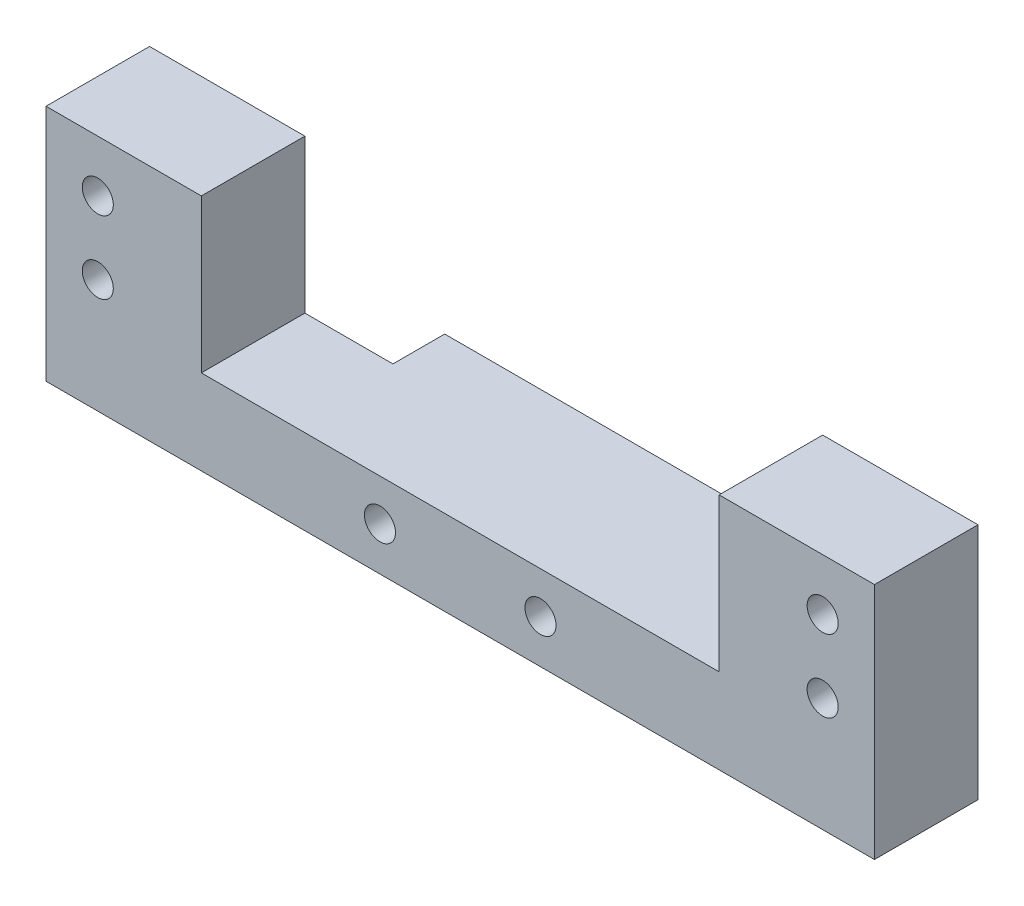
ISO-10303-21;
HEADER;
FILE_DESCRIPTION(('STEP AP214'),'2;1');
FILE_NAME('part.step','',(''),(''),'','','');
FILE_SCHEMA(('AUTOMOTIVE_DESIGN { 1 0 10303 214 1 1 1 1 }'));
ENDSEC;
DATA;
#1=APPLICATION_CONTEXT('core data for automotive mechanical design processes');
#2=APPLICATION_PROTOCOL_DEFINITION('international standard','automotive_design',2000,#1);
#3=PRODUCT_CONTEXT('',#1,'mechanical');
#4=PRODUCT('Part','Part','',(#3));
#5=PRODUCT_RELATED_PRODUCT_CATEGORY('part','',(#4));
#6=PRODUCT_DEFINITION_FORMATION('','',#4);
#7=PRODUCT_DEFINITION_CONTEXT('part definition',#1,'design');
#8=PRODUCT_DEFINITION('design','',#6,#7);
#9=PRODUCT_DEFINITION_SHAPE('','',#8);
#10=(LENGTH_UNIT() NAMED_UNIT(*) SI_UNIT(.MILLI.,.METRE.));
#11=(NAMED_UNIT(*) PLANE_ANGLE_UNIT() SI_UNIT($,.RADIAN.));
#12=(NAMED_UNIT(*) SI_UNIT($,.STERADIAN.) SOLID_ANGLE_UNIT());
#13=UNCERTAINTY_MEASURE_WITH_UNIT(LENGTH_MEASURE(1.E-05),#10,'distance_accuracy_value','');
#14=(GEOMETRIC_REPRESENTATION_CONTEXT(3) GLOBAL_UNCERTAINTY_ASSIGNED_CONTEXT((#13)) GLOBAL_UNIT_ASSIGNED_CONTEXT((#10,
#11,#12)) REPRESENTATION_CONTEXT('',''));
#15=CARTESIAN_POINT('',(0.,0.,0.));
#16=DIRECTION('',(0.,0.,1.));
#17=DIRECTION('',(1.,0.,0.));
#18=AXIS2_PLACEMENT_3D('',#15,#16,#17);
#19=CARTESIAN_POINT('',(0.,0.,0.));
#20=DIRECTION('',(0.,0.,-1.));
#21=DIRECTION('',(-1.,0.,0.));
#22=AXIS2_PLACEMENT_3D('',#19,#20,#21);
#23=PLANE('',#22);
#24=DIRECTION('',(0.,-1.,0.));
#25=VECTOR('',#24,1.);
#26=CARTESIAN_POINT('',(56.5,8.2,0.));
#27=LINE('',#26,#25);
#28=CARTESIAN_POINT('',(56.5,8.2,0.));
#29=VERTEX_POINT('',#28);
#30=CARTESIAN_POINT('',(56.5,0.,0.));
#31=VERTEX_POINT('',#30);
#32=EDGE_CURVE('E149',#29,#31,#27,.T.);
#33=ORIENTED_EDGE('',*,*,#32,.F.);
#34=DIRECTION('',(1.,0.,0.));
#35=VECTOR('',#34,1.);
#36=CARTESIAN_POINT('',(15.,8.2,0.));
#37=LINE('',#36,#35);
#38=CARTESIAN_POINT('',(65.,8.2,0.));
#39=VERTEX_POINT('',#38);
#40=EDGE_CURVE('E183',#29,#39,#37,.T.);
#41=ORIENTED_EDGE('',*,*,#40,.T.);
#42=DIRECTION('',(0.,1.,0.));
#43=VECTOR('',#42,1.);
#44=CARTESIAN_POINT('',(65.,23.,0.));
#45=LINE('',#44,#43);
#46=CARTESIAN_POINT('',(65.,23.,0.));
#47=VERTEX_POINT('',#46);
#48=EDGE_CURVE('E187',#39,#47,#45,.T.);
#49=ORIENTED_EDGE('',*,*,#48,.T.);
#50=DIRECTION('',(-1.,0.,0.));
#51=VECTOR('',#50,1.);
#52=CARTESIAN_POINT('',(0.,23.,0.));
#53=LINE('',#52,#51);
#54=CARTESIAN_POINT('',(80.,23.,0.));
#55=VERTEX_POINT('',#54);
#56=EDGE_CURVE('E210',#55,#47,#53,.T.);
#57=ORIENTED_EDGE('',*,*,#56,.F.);
#58=DIRECTION('',(0.,1.,0.));
#59=VECTOR('',#58,1.);
#60=CARTESIAN_POINT('',(80.,0.,0.));
#61=LINE('',#60,#59);
#62=CARTESIAN_POINT('',(80.,0.,0.));
#63=VERTEX_POINT('',#62);
#64=EDGE_CURVE('E223',#63,#55,#61,.T.);
#65=ORIENTED_EDGE('',*,*,#64,.F.);
#66=DIRECTION('',(1.,0.,0.));
#67=VECTOR('',#66,1.);
#68=CARTESIAN_POINT('',(0.,0.,0.));
#69=LINE('',#68,#67);
#70=EDGE_CURVE('E54',#31,#63,#69,.T.);
#71=ORIENTED_EDGE('',*,*,#70,.F.);
#72=EDGE_LOOP('',(#33,#41,#49,#57,#65,#71));
#73=FACE_BOUND('',#72,.T.);
#74=CARTESIAN_POINT('',(75.,11.,0.));
#75=DIRECTION('',(0.,0.,1.));
#76=DIRECTION('',(-1.,0.,0.));
#77=AXIS2_PLACEMENT_3D('',#74,#75,#76);
#78=CIRCLE('',#77,1.5);
#79=CARTESIAN_POINT('',(73.5,11.,0.));
#80=VERTEX_POINT('',#79);
#81=EDGE_CURVE('E166',#80,#80,#78,.T.);
#82=ORIENTED_EDGE('',*,*,#81,.T.);
#83=EDGE_LOOP('',(#82));
#84=FACE_BOUND('',#83,.T.);
#85=CARTESIAN_POINT('',(75.,18.,0.));
#86=DIRECTION('',(0.,0.,1.));
#87=DIRECTION('',(-1.,0.,0.));
#88=AXIS2_PLACEMENT_3D('',#85,#86,#87);
#89=CIRCLE('',#88,1.50000000000001);
#90=CARTESIAN_POINT('',(73.5,18.,0.));
#91=VERTEX_POINT('',#90);
#92=EDGE_CURVE('E153',#91,#91,#89,.T.);
#93=ORIENTED_EDGE('',*,*,#92,.T.);
#94=EDGE_LOOP('',(#93));
#95=FACE_BOUND('',#94,.T.);
#96=ADVANCED_FACE('F37',(#73,#84,#95),#23,.T.);
#97=CARTESIAN_POINT('',(0.,23.,10.));
#98=DIRECTION('',(0.,-1.,0.));
#99=DIRECTION('',(0.,0.,-1.));
#100=AXIS2_PLACEMENT_3D('',#97,#98,#99);
#101=PLANE('',#100);
#102=DIRECTION('',(-1.,0.,0.));
#103=VECTOR('',#102,1.);
#104=CARTESIAN_POINT('',(0.,23.,10.));
#105=LINE('',#104,#103);
#106=CARTESIAN_POINT('',(15.,23.,10.));
#107=VERTEX_POINT('',#106);
#108=CARTESIAN_POINT('',(0.,23.,10.));
#109=VERTEX_POINT('',#108);
#110=EDGE_CURVE('E214',#107,#109,#105,.T.);
#111=ORIENTED_EDGE('',*,*,#110,.F.);
#112=DIRECTION('',(0.,0.,1.));
#113=VECTOR('',#112,1.);
#114=CARTESIAN_POINT('',(15.,23.,0.));
#115=LINE('',#114,#113);
#116=CARTESIAN_POINT('',(15.,23.,0.));
#117=VERTEX_POINT('',#116);
#118=EDGE_CURVE('E197',#117,#107,#115,.T.);
#119=ORIENTED_EDGE('',*,*,#118,.F.);
#120=CARTESIAN_POINT('',(0.,23.,0.));
#121=VERTEX_POINT('',#120);
#122=EDGE_CURVE('E225',#117,#121,#53,.T.);
#123=ORIENTED_EDGE('',*,*,#122,.T.);
#124=DIRECTION('',(0.,0.,-1.));
#125=VECTOR('',#124,1.);
#126=CARTESIAN_POINT('',(0.,23.,10.));
#127=LINE('',#126,#125);
#128=EDGE_CURVE('E218',#109,#121,#127,.T.);
#129=ORIENTED_EDGE('',*,*,#128,.F.);
#130=EDGE_LOOP('',(#111,#119,#123,#129));
#131=FACE_BOUND('',#130,.T.);
#132=ADVANCED_FACE('F272',(#131),#101,.F.);
#133=CARTESIAN_POINT('',(0.,0.,10.));
#134=DIRECTION('',(1.,0.,0.));
#135=DIRECTION('',(0.,0.,-1.));
#136=AXIS2_PLACEMENT_3D('',#133,#134,#135);
#137=PLANE('',#136);
#138=DIRECTION('',(0.,-1.,0.));
#139=VECTOR('',#138,1.);
#140=CARTESIAN_POINT('',(0.,0.,0.));
#141=LINE('',#140,#139);
#142=CARTESIAN_POINT('',(0.,0.,0.));
#143=VERTEX_POINT('',#142);
#144=EDGE_CURVE('E199',#121,#143,#141,.T.);
#145=ORIENTED_EDGE('',*,*,#144,.T.);
#146=DIRECTION('',(0.,0.,-1.));
#147=VECTOR('',#146,1.);
#148=CARTESIAN_POINT('',(0.,0.,10.));
#149=LINE('',#148,#147);
#150=CARTESIAN_POINT('',(0.,0.,10.));
#151=VERTEX_POINT('',#150);
#152=EDGE_CURVE('E11',#151,#143,#149,.T.);
#153=ORIENTED_EDGE('',*,*,#152,.F.);
#154=DIRECTION('',(0.,-1.,0.));
#155=VECTOR('',#154,1.);
#156=CARTESIAN_POINT('',(0.,0.,10.));
#157=LINE('',#156,#155);
#158=EDGE_CURVE('E206',#109,#151,#157,.T.);
#159=ORIENTED_EDGE('',*,*,#158,.F.);
#160=ORIENTED_EDGE('',*,*,#128,.T.);
#161=EDGE_LOOP('',(#145,#153,#159,#160));
#162=FACE_BOUND('',#161,.T.);
#163=ADVANCED_FACE('F39',(#162),#137,.F.);
#164=CARTESIAN_POINT('',(0.,0.,10.));
#165=DIRECTION('',(0.,1.,0.));
#166=DIRECTION('',(0.,0.,1.));
#167=AXIS2_PLACEMENT_3D('',#164,#165,#166);
#168=PLANE('',#167);
#169=CARTESIAN_POINT('',(23.5,0.,0.));
#170=VERTEX_POINT('',#169);
#171=EDGE_CURVE('E221',#143,#170,#69,.T.);
#172=ORIENTED_EDGE('',*,*,#171,.T.);
#173=DIRECTION('',(0.,0.,1.));
#174=VECTOR('',#173,1.);
#175=CARTESIAN_POINT('',(23.5,0.,-5.));
#176=LINE('',#175,#174);
#177=CARTESIAN_POINT('',(23.5,0.,-5.));
#178=VERTEX_POINT('',#177);
#179=EDGE_CURVE('E134',#178,#170,#176,.T.);
#180=ORIENTED_EDGE('',*,*,#179,.F.);
#181=DIRECTION('',(-1.,0.,0.));
#182=VECTOR('',#181,1.);
#183=CARTESIAN_POINT('',(56.5,0.,-5.));
#184=LINE('',#183,#182);
#185=CARTESIAN_POINT('',(56.5,0.,-5.));
#186=VERTEX_POINT('',#185);
#187=EDGE_CURVE('E127',#186,#178,#184,.T.);
#188=ORIENTED_EDGE('',*,*,#187,.F.);
#189=DIRECTION('',(0.,0.,1.));
#190=VECTOR('',#189,1.);
#191=CARTESIAN_POINT('',(56.5,0.,-5.));
#192=LINE('',#191,#190);
#193=EDGE_CURVE('E131',#186,#31,#192,.T.);
#194=ORIENTED_EDGE('',*,*,#193,.T.);
#195=ORIENTED_EDGE('',*,*,#70,.T.);
#196=DIRECTION('',(0.,0.,-1.));
#197=VECTOR('',#196,1.);
#198=CARTESIAN_POINT('',(80.,0.,10.));
#199=LINE('',#198,#197);
#200=CARTESIAN_POINT('',(80.,0.,10.));
#201=VERTEX_POINT('',#200);
#202=EDGE_CURVE('E46',#201,#63,#199,.T.);
#203=ORIENTED_EDGE('',*,*,#202,.F.);
#204=DIRECTION('',(1.,0.,0.));
#205=VECTOR('',#204,1.);
#206=CARTESIAN_POINT('',(0.,0.,10.));
#207=LINE('',#206,#205);
#208=EDGE_CURVE('E209',#151,#201,#207,.T.);
#209=ORIENTED_EDGE('',*,*,#208,.F.);
#210=ORIENTED_EDGE('',*,*,#152,.T.);
#211=EDGE_LOOP('',(#172,#180,#188,#194,#195,#203,#209,#210));
#212=FACE_BOUND('',#211,.T.);
#213=ADVANCED_FACE('F129',(#212),#168,.F.);
#214=CARTESIAN_POINT('',(80.,0.,10.));
#215=DIRECTION('',(-1.,0.,0.));
#216=DIRECTION('',(0.,0.,1.));
#217=AXIS2_PLACEMENT_3D('',#214,#215,#216);
#218=PLANE('',#217);
#219=ORIENTED_EDGE('',*,*,#64,.T.);
#220=DIRECTION('',(0.,0.,-1.));
#221=VECTOR('',#220,1.);
#222=CARTESIAN_POINT('',(80.,23.,10.));
#223=LINE('',#222,#221);
#224=CARTESIAN_POINT('',(80.,23.,10.));
#225=VERTEX_POINT('',#224);
#226=EDGE_CURVE('E230',#225,#55,#223,.T.);
#227=ORIENTED_EDGE('',*,*,#226,.F.);
#228=DIRECTION('',(0.,1.,0.));
#229=VECTOR('',#228,1.);
#230=CARTESIAN_POINT('',(80.,0.,10.));
#231=LINE('',#230,#229);
#232=EDGE_CURVE('E212',#201,#225,#231,.T.);
#233=ORIENTED_EDGE('',*,*,#232,.F.);
#234=ORIENTED_EDGE('',*,*,#202,.T.);
#235=EDGE_LOOP('',(#219,#227,#233,#234));
#236=FACE_BOUND('',#235,.T.);
#237=ADVANCED_FACE('F324',(#236),#218,.F.);
#238=ORIENTED_EDGE('',*,*,#56,.T.);
#239=DIRECTION('',(0.,0.,1.));
#240=VECTOR('',#239,1.);
#241=CARTESIAN_POINT('',(65.,23.,0.));
#242=LINE('',#241,#240);
#243=CARTESIAN_POINT('',(65.,23.,10.));
#244=VERTEX_POINT('',#243);
#245=EDGE_CURVE('E200',#47,#244,#242,.T.);
#246=ORIENTED_EDGE('',*,*,#245,.T.);
#247=EDGE_CURVE('E215',#225,#244,#105,.T.);
#248=ORIENTED_EDGE('',*,*,#247,.F.);
#249=ORIENTED_EDGE('',*,*,#226,.T.);
#250=EDGE_LOOP('',(#238,#246,#248,#249));
#251=FACE_BOUND('',#250,.T.);
#252=ADVANCED_FACE('F280',(#251),#101,.F.);
#253=CARTESIAN_POINT('',(0.,0.,10.));
#254=DIRECTION('',(0.,0.,-1.));
#255=DIRECTION('',(-1.,0.,0.));
#256=AXIS2_PLACEMENT_3D('',#253,#254,#255);
#257=PLANE('',#256);
#258=CARTESIAN_POINT('',(32.25,4.2,10.));
#259=DIRECTION('',(0.,0.,1.));
#260=DIRECTION('',(1.,0.,0.));
#261=AXIS2_PLACEMENT_3D('',#258,#259,#260);
#262=CIRCLE('',#261,1.5);
#263=CARTESIAN_POINT('',(33.75,4.2,10.));
#264=VERTEX_POINT('',#263);
#265=EDGE_CURVE('E236',#264,#264,#262,.T.);
#266=ORIENTED_EDGE('',*,*,#265,.F.);
#267=EDGE_LOOP('',(#266));
#268=FACE_BOUND('',#267,.T.);
#269=CARTESIAN_POINT('',(47.75,4.2,10.));
#270=DIRECTION('',(0.,0.,1.));
#271=DIRECTION('',(-1.,0.,0.));
#272=AXIS2_PLACEMENT_3D('',#269,#270,#271);
#273=CIRCLE('',#272,1.5);
#274=CARTESIAN_POINT('',(46.25,4.2,10.));
#275=VERTEX_POINT('',#274);
#276=EDGE_CURVE('E241',#275,#275,#273,.T.);
#277=ORIENTED_EDGE('',*,*,#276,.F.);
#278=EDGE_LOOP('',(#277));
#279=FACE_BOUND('',#278,.T.);
#280=CARTESIAN_POINT('',(75.,18.,10.));
#281=DIRECTION('',(0.,0.,1.));
#282=DIRECTION('',(-1.,0.,0.));
#283=AXIS2_PLACEMENT_3D('',#280,#281,#282);
#284=CIRCLE('',#283,1.50000000000001);
#285=CARTESIAN_POINT('',(73.5,18.,10.));
#286=VERTEX_POINT('',#285);
#287=EDGE_CURVE('E150',#286,#286,#284,.T.);
#288=ORIENTED_EDGE('',*,*,#287,.F.);
#289=EDGE_LOOP('',(#288));
#290=FACE_BOUND('',#289,.T.);
#291=CARTESIAN_POINT('',(75.,11.,10.));
#292=DIRECTION('',(0.,0.,1.));
#293=DIRECTION('',(-1.,0.,0.));
#294=AXIS2_PLACEMENT_3D('',#291,#292,#293);
#295=CIRCLE('',#294,1.5);
#296=CARTESIAN_POINT('',(73.5,11.,10.));
#297=VERTEX_POINT('',#296);
#298=EDGE_CURVE('E169',#297,#297,#295,.T.);
#299=ORIENTED_EDGE('',*,*,#298,.F.);
#300=EDGE_LOOP('',(#299));
#301=FACE_BOUND('',#300,.T.);
#302=CARTESIAN_POINT('',(5.,11.,10.));
#303=DIRECTION('',(0.,0.,1.));
#304=DIRECTION('',(1.,0.,0.));
#305=AXIS2_PLACEMENT_3D('',#302,#303,#304);
#306=CIRCLE('',#305,1.5);
#307=CARTESIAN_POINT('',(6.5,11.,10.));
#308=VERTEX_POINT('',#307);
#309=EDGE_CURVE('E163',#308,#308,#306,.T.);
#310=ORIENTED_EDGE('',*,*,#309,.F.);
#311=EDGE_LOOP('',(#310));
#312=FACE_BOUND('',#311,.T.);
#313=CARTESIAN_POINT('',(5.,18.,10.));
#314=DIRECTION('',(0.,0.,1.));
#315=DIRECTION('',(1.,0.,0.));
#316=AXIS2_PLACEMENT_3D('',#313,#314,#315);
#317=CIRCLE('',#316,1.5);
#318=CARTESIAN_POINT('',(6.5,18.,10.));
#319=VERTEX_POINT('',#318);
#320=EDGE_CURVE('E162',#319,#319,#317,.T.);
#321=ORIENTED_EDGE('',*,*,#320,.F.);
#322=EDGE_LOOP('',(#321));
#323=FACE_BOUND('',#322,.T.);
#324=DIRECTION('',(1.,0.,0.));
#325=VECTOR('',#324,1.);
#326=CARTESIAN_POINT('',(15.,8.2,10.));
#327=LINE('',#326,#325);
#328=CARTESIAN_POINT('',(15.,8.2,10.));
#329=VERTEX_POINT('',#328);
#330=CARTESIAN_POINT('',(65.,8.2,10.));
#331=VERTEX_POINT('',#330);
#332=EDGE_CURVE('E193',#329,#331,#327,.T.);
#333=ORIENTED_EDGE('',*,*,#332,.F.);
#334=DIRECTION('',(0.,-1.,0.));
#335=VECTOR('',#334,1.);
#336=CARTESIAN_POINT('',(15.,23.,10.));
#337=LINE('',#336,#335);
#338=EDGE_CURVE('E177',#107,#329,#337,.T.);
#339=ORIENTED_EDGE('',*,*,#338,.F.);
#340=ORIENTED_EDGE('',*,*,#110,.T.);
#341=ORIENTED_EDGE('',*,*,#158,.T.);
#342=ORIENTED_EDGE('',*,*,#208,.T.);
#343=ORIENTED_EDGE('',*,*,#232,.T.);
#344=ORIENTED_EDGE('',*,*,#247,.T.);
#345=DIRECTION('',(0.,1.,0.));
#346=VECTOR('',#345,1.);
#347=CARTESIAN_POINT('',(65.,23.,10.));
#348=LINE('',#347,#346);
#349=EDGE_CURVE('E184',#331,#244,#348,.T.);
#350=ORIENTED_EDGE('',*,*,#349,.F.);
#351=EDGE_LOOP('',(#333,#339,#340,#341,#342,#343,#344,#350));
#352=FACE_BOUND('',#351,.T.);
#353=ADVANCED_FACE('F285',(#268,#279,#290,#301,#312,#323,#352),#257,.F.);
#354=DIRECTION('',(0.,1.,0.));
#355=VECTOR('',#354,1.);
#356=CARTESIAN_POINT('',(23.5,8.2,0.));
#357=LINE('',#356,#355);
#358=CARTESIAN_POINT('',(23.5,8.2,0.));
#359=VERTEX_POINT('',#358);
#360=EDGE_CURVE('E62',#170,#359,#357,.T.);
#361=ORIENTED_EDGE('',*,*,#360,.F.);
#362=ORIENTED_EDGE('',*,*,#171,.F.);
#363=ORIENTED_EDGE('',*,*,#144,.F.);
#364=ORIENTED_EDGE('',*,*,#122,.F.);
#365=DIRECTION('',(0.,-1.,0.));
#366=VECTOR('',#365,1.);
#367=CARTESIAN_POINT('',(15.,23.,0.));
#368=LINE('',#367,#366);
#369=CARTESIAN_POINT('',(15.,8.2,0.));
#370=VERTEX_POINT('',#369);
#371=EDGE_CURVE('E180',#117,#370,#368,.T.);
#372=ORIENTED_EDGE('',*,*,#371,.T.);
#373=EDGE_CURVE('E185',#370,#359,#37,.T.);
#374=ORIENTED_EDGE('',*,*,#373,.T.);
#375=EDGE_LOOP('',(#361,#362,#363,#364,#372,#374));
#376=FACE_BOUND('',#375,.T.);
#377=CARTESIAN_POINT('',(5.,11.,0.));
#378=DIRECTION('',(0.,0.,1.));
#379=DIRECTION('',(1.,0.,0.));
#380=AXIS2_PLACEMENT_3D('',#377,#378,#379);
#381=CIRCLE('',#380,1.5);
#382=CARTESIAN_POINT('',(6.5,11.,0.));
#383=VERTEX_POINT('',#382);
#384=EDGE_CURVE('E159',#383,#383,#381,.T.);
#385=ORIENTED_EDGE('',*,*,#384,.T.);
#386=EDGE_LOOP('',(#385));
#387=FACE_BOUND('',#386,.T.);
#388=CARTESIAN_POINT('',(5.,18.,0.));
#389=DIRECTION('',(0.,0.,1.));
#390=DIRECTION('',(1.,0.,0.));
#391=AXIS2_PLACEMENT_3D('',#388,#389,#390);
#392=CIRCLE('',#391,1.5);
#393=CARTESIAN_POINT('',(6.5,18.,0.));
#394=VERTEX_POINT('',#393);
#395=EDGE_CURVE('E174',#394,#394,#392,.T.);
#396=ORIENTED_EDGE('',*,*,#395,.T.);
#397=EDGE_LOOP('',(#396));
#398=FACE_BOUND('',#397,.T.);
#399=ADVANCED_FACE('F274',(#376,#387,#398),#23,.T.);
#400=CARTESIAN_POINT('',(15.,23.,0.));
#401=DIRECTION('',(-1.,0.,0.));
#402=DIRECTION('',(0.,-1.,0.));
#403=AXIS2_PLACEMENT_3D('',#400,#401,#402);
#404=PLANE('',#403);
#405=ORIENTED_EDGE('',*,*,#338,.T.);
#406=DIRECTION('',(0.,0.,1.));
#407=VECTOR('',#406,1.);
#408=CARTESIAN_POINT('',(15.,8.2,0.));
#409=LINE('',#408,#407);
#410=EDGE_CURVE('E190',#370,#329,#409,.T.);
#411=ORIENTED_EDGE('',*,*,#410,.F.);
#412=ORIENTED_EDGE('',*,*,#371,.F.);
#413=ORIENTED_EDGE('',*,*,#118,.T.);
#414=EDGE_LOOP('',(#405,#411,#412,#413));
#415=FACE_BOUND('',#414,.T.);
#416=ADVANCED_FACE('F284',(#415),#404,.F.);
#417=CARTESIAN_POINT('',(65.,23.,0.));
#418=DIRECTION('',(1.,0.,0.));
#419=DIRECTION('',(0.,0.,-1.));
#420=AXIS2_PLACEMENT_3D('',#417,#418,#419);
#421=PLANE('',#420);
#422=ORIENTED_EDGE('',*,*,#349,.T.);
#423=ORIENTED_EDGE('',*,*,#245,.F.);
#424=ORIENTED_EDGE('',*,*,#48,.F.);
#425=DIRECTION('',(0.,0.,1.));
#426=VECTOR('',#425,1.);
#427=CARTESIAN_POINT('',(65.,8.2,0.));
#428=LINE('',#427,#426);
#429=EDGE_CURVE('E203',#39,#331,#428,.T.);
#430=ORIENTED_EDGE('',*,*,#429,.T.);
#431=EDGE_LOOP('',(#422,#423,#424,#430));
#432=FACE_BOUND('',#431,.T.);
#433=ADVANCED_FACE('F290',(#432),#421,.F.);
#434=CARTESIAN_POINT('',(15.,8.2,0.));
#435=DIRECTION('',(0.,-1.,0.));
#436=DIRECTION('',(0.,0.,-1.));
#437=AXIS2_PLACEMENT_3D('',#434,#435,#436);
#438=PLANE('',#437);
#439=ORIENTED_EDGE('',*,*,#332,.T.);
#440=ORIENTED_EDGE('',*,*,#429,.F.);
#441=ORIENTED_EDGE('',*,*,#40,.F.);
#442=DIRECTION('',(0.,0.,1.));
#443=VECTOR('',#442,1.);
#444=CARTESIAN_POINT('',(56.5,8.2,-5.));
#445=LINE('',#444,#443);
#446=CARTESIAN_POINT('',(56.5,8.2,-5.));
#447=VERTEX_POINT('',#446);
#448=EDGE_CURVE('E250',#447,#29,#445,.T.);
#449=ORIENTED_EDGE('',*,*,#448,.F.);
#450=DIRECTION('',(1.,0.,0.));
#451=VECTOR('',#450,1.);
#452=CARTESIAN_POINT('',(56.5,8.2,-5.));
#453=LINE('',#452,#451);
#454=CARTESIAN_POINT('',(23.5,8.2,-5.));
#455=VERTEX_POINT('',#454);
#456=EDGE_CURVE('E143',#455,#447,#453,.T.);
#457=ORIENTED_EDGE('',*,*,#456,.F.);
#458=DIRECTION('',(0.,0.,1.));
#459=VECTOR('',#458,1.);
#460=CARTESIAN_POINT('',(23.5,8.2,-5.));
#461=LINE('',#460,#459);
#462=EDGE_CURVE('E155',#455,#359,#461,.T.);
#463=ORIENTED_EDGE('',*,*,#462,.T.);
#464=ORIENTED_EDGE('',*,*,#373,.F.);
#465=ORIENTED_EDGE('',*,*,#410,.T.);
#466=EDGE_LOOP('',(#439,#440,#441,#449,#457,#463,#464,#465));
#467=FACE_BOUND('',#466,.T.);
#468=ADVANCED_FACE('F257',(#467),#438,.F.);
#469=CARTESIAN_POINT('',(5.,18.,0.));
#470=DIRECTION('',(0.,0.,1.));
#471=DIRECTION('',(1.,0.,0.));
#472=AXIS2_PLACEMENT_3D('',#469,#470,#471);
#473=CYLINDRICAL_SURFACE('',#472,1.5);
#474=ORIENTED_EDGE('',*,*,#395,.F.);
#475=EDGE_LOOP('',(#474));
#476=FACE_BOUND('',#475,.T.);
#477=ORIENTED_EDGE('',*,*,#320,.T.);
#478=EDGE_LOOP('',(#477));
#479=FACE_BOUND('',#478,.T.);
#480=ADVANCED_FACE('F299',(#476,#479),#473,.F.);
#481=CARTESIAN_POINT('',(5.,11.,0.));
#482=DIRECTION('',(0.,0.,1.));
#483=DIRECTION('',(1.,0.,0.));
#484=AXIS2_PLACEMENT_3D('',#481,#482,#483);
#485=CYLINDRICAL_SURFACE('',#484,1.5);
#486=ORIENTED_EDGE('',*,*,#384,.F.);
#487=EDGE_LOOP('',(#486));
#488=FACE_BOUND('',#487,.T.);
#489=ORIENTED_EDGE('',*,*,#309,.T.);
#490=EDGE_LOOP('',(#489));
#491=FACE_BOUND('',#490,.T.);
#492=ADVANCED_FACE('F302',(#488,#491),#485,.F.);
#493=CARTESIAN_POINT('',(75.,11.,0.));
#494=DIRECTION('',(0.,0.,1.));
#495=DIRECTION('',(1.,0.,0.));
#496=AXIS2_PLACEMENT_3D('',#493,#494,#495);
#497=CYLINDRICAL_SURFACE('',#496,1.5);
#498=ORIENTED_EDGE('',*,*,#81,.F.);
#499=EDGE_LOOP('',(#498));
#500=FACE_BOUND('',#499,.T.);
#501=ORIENTED_EDGE('',*,*,#298,.T.);
#502=EDGE_LOOP('',(#501));
#503=FACE_BOUND('',#502,.T.);
#504=ADVANCED_FACE('F339',(#500,#503),#497,.F.);
#505=CARTESIAN_POINT('',(75.,18.,0.));
#506=DIRECTION('',(0.,0.,1.));
#507=DIRECTION('',(1.,0.,0.));
#508=AXIS2_PLACEMENT_3D('',#505,#506,#507);
#509=CYLINDRICAL_SURFACE('',#508,1.50000000000001);
#510=ORIENTED_EDGE('',*,*,#92,.F.);
#511=EDGE_LOOP('',(#510));
#512=FACE_BOUND('',#511,.T.);
#513=ORIENTED_EDGE('',*,*,#287,.T.);
#514=EDGE_LOOP('',(#513));
#515=FACE_BOUND('',#514,.T.);
#516=ADVANCED_FACE('F269',(#512,#515),#509,.F.);
#517=CARTESIAN_POINT('',(56.5,8.2,-5.));
#518=DIRECTION('',(-1.,0.,0.));
#519=DIRECTION('',(0.,0.,1.));
#520=AXIS2_PLACEMENT_3D('',#517,#518,#519);
#521=PLANE('',#520);
#522=ORIENTED_EDGE('',*,*,#32,.T.);
#523=ORIENTED_EDGE('',*,*,#193,.F.);
#524=DIRECTION('',(0.,-1.,0.));
#525=VECTOR('',#524,1.);
#526=CARTESIAN_POINT('',(56.5,8.2,-5.));
#527=LINE('',#526,#525);
#528=EDGE_CURVE('E138',#447,#186,#527,.T.);
#529=ORIENTED_EDGE('',*,*,#528,.F.);
#530=ORIENTED_EDGE('',*,*,#448,.T.);
#531=EDGE_LOOP('',(#522,#523,#529,#530));
#532=FACE_BOUND('',#531,.T.);
#533=ADVANCED_FACE('F148',(#532),#521,.F.);
#534=CARTESIAN_POINT('',(23.5,8.2,-5.));
#535=DIRECTION('',(1.,0.,0.));
#536=DIRECTION('',(0.,0.,-1.));
#537=AXIS2_PLACEMENT_3D('',#534,#535,#536);
#538=PLANE('',#537);
#539=ORIENTED_EDGE('',*,*,#360,.T.);
#540=ORIENTED_EDGE('',*,*,#462,.F.);
#541=DIRECTION('',(0.,1.,0.));
#542=VECTOR('',#541,1.);
#543=CARTESIAN_POINT('',(23.5,8.2,-5.));
#544=LINE('',#543,#542);
#545=EDGE_CURVE('E137',#178,#455,#544,.T.);
#546=ORIENTED_EDGE('',*,*,#545,.F.);
#547=ORIENTED_EDGE('',*,*,#179,.T.);
#548=EDGE_LOOP('',(#539,#540,#546,#547));
#549=FACE_BOUND('',#548,.T.);
#550=ADVANCED_FACE('F259',(#549),#538,.F.);
#551=CARTESIAN_POINT('',(0.,0.,-5.));
#552=DIRECTION('',(0.,0.,-1.));
#553=DIRECTION('',(-1.,0.,0.));
#554=AXIS2_PLACEMENT_3D('',#551,#552,#553);
#555=PLANE('',#554);
#556=CARTESIAN_POINT('',(32.25,4.2,-5.));
#557=DIRECTION('',(0.,0.,-1.));
#558=DIRECTION('',(-1.,0.,0.));
#559=AXIS2_PLACEMENT_3D('',#556,#557,#558);
#560=CIRCLE('',#559,1.5);
#561=CARTESIAN_POINT('',(30.75,4.2,-5.));
#562=VERTEX_POINT('',#561);
#563=EDGE_CURVE('E41',#562,#562,#560,.T.);
#564=ORIENTED_EDGE('',*,*,#563,.F.);
#565=EDGE_LOOP('',(#564));
#566=FACE_BOUND('',#565,.T.);
#567=CARTESIAN_POINT('',(47.75,4.2,-5.));
#568=DIRECTION('',(0.,0.,-1.));
#569=DIRECTION('',(-1.,0.,0.));
#570=AXIS2_PLACEMENT_3D('',#567,#568,#569);
#571=CIRCLE('',#570,1.5);
#572=CARTESIAN_POINT('',(46.25,4.2,-5.));
#573=VERTEX_POINT('',#572);
#574=EDGE_CURVE('E234',#573,#573,#571,.T.);
#575=ORIENTED_EDGE('',*,*,#574,.F.);
#576=EDGE_LOOP('',(#575));
#577=FACE_BOUND('',#576,.T.);
#578=ORIENTED_EDGE('',*,*,#528,.T.);
#579=ORIENTED_EDGE('',*,*,#187,.T.);
#580=ORIENTED_EDGE('',*,*,#545,.T.);
#581=ORIENTED_EDGE('',*,*,#456,.T.);
#582=EDGE_LOOP('',(#578,#579,#580,#581));
#583=FACE_BOUND('',#582,.T.);
#584=ADVANCED_FACE('F141',(#566,#577,#583),#555,.T.);
#585=CARTESIAN_POINT('',(47.75,4.2,-9.00000000000001));
#586=DIRECTION('',(0.,0.,1.));
#587=DIRECTION('',(1.,0.,0.));
#588=AXIS2_PLACEMENT_3D('',#585,#586,#587);
#589=CYLINDRICAL_SURFACE('',#588,1.5);
#590=ORIENTED_EDGE('',*,*,#574,.T.);
#591=EDGE_LOOP('',(#590));
#592=FACE_BOUND('',#591,.T.);
#593=ORIENTED_EDGE('',*,*,#276,.T.);
#594=EDGE_LOOP('',(#593));
#595=FACE_BOUND('',#594,.T.);
#596=ADVANCED_FACE('F266',(#592,#595),#589,.F.);
#597=CARTESIAN_POINT('',(32.25,4.2,-9.00000000000001));
#598=DIRECTION('',(0.,0.,1.));
#599=DIRECTION('',(1.,0.,0.));
#600=AXIS2_PLACEMENT_3D('',#597,#598,#599);
#601=CYLINDRICAL_SURFACE('',#600,1.5);
#602=ORIENTED_EDGE('',*,*,#563,.T.);
#603=EDGE_LOOP('',(#602));
#604=FACE_BOUND('',#603,.T.);
#605=ORIENTED_EDGE('',*,*,#265,.T.);
#606=EDGE_LOOP('',(#605));
#607=FACE_BOUND('',#606,.T.);
#608=ADVANCED_FACE('F396',(#604,#607),#601,.F.);
#609=CLOSED_SHELL('',(#96,#132,#163,#213,#237,#252,#353,#399,#416,#433,#468,#480,#492,#504,#516,
#533,#550,#584,#596,#608));
#610=MANIFOLD_SOLID_BREP('B2',#609);
#611=ADVANCED_BREP_SHAPE_REPRESENTATION('',(#18,#610),#14);
#612=SHAPE_DEFINITION_REPRESENTATION(#9,#611);
ENDSEC;
END-ISO-10303-21;
